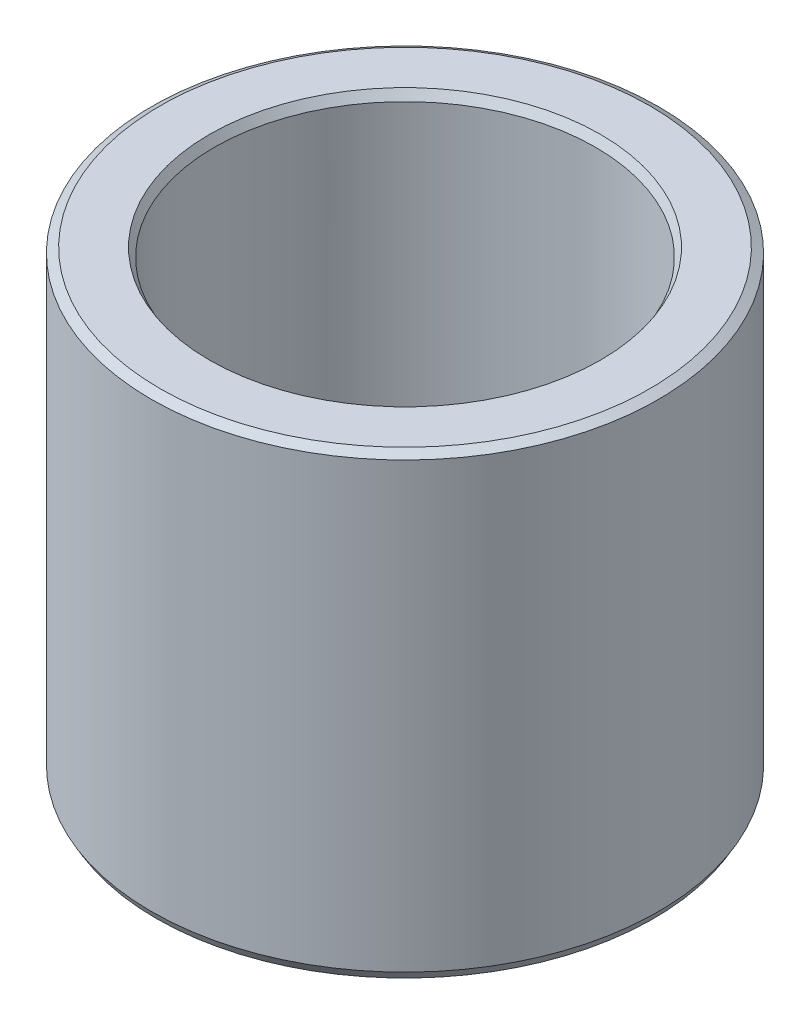
ISO-10303-21;
HEADER;
FILE_DESCRIPTION(('STEP AP214'),'2;1');
FILE_NAME('part.step','',(''),(''),'','','');
FILE_SCHEMA(('AUTOMOTIVE_DESIGN { 1 0 10303 214 1 1 1 1 }'));
ENDSEC;
DATA;
#1=APPLICATION_CONTEXT('core data for automotive mechanical design processes');
#2=APPLICATION_PROTOCOL_DEFINITION('international standard','automotive_design',2000,#1);
#3=PRODUCT_CONTEXT('',#1,'mechanical');
#4=PRODUCT('Part','Part','',(#3));
#5=PRODUCT_RELATED_PRODUCT_CATEGORY('part','',(#4));
#6=PRODUCT_DEFINITION_FORMATION('','',#4);
#7=PRODUCT_DEFINITION_CONTEXT('part definition',#1,'design');
#8=PRODUCT_DEFINITION('design','',#6,#7);
#9=PRODUCT_DEFINITION_SHAPE('','',#8);
#10=(LENGTH_UNIT() NAMED_UNIT(*) SI_UNIT(.MILLI.,.METRE.));
#11=(NAMED_UNIT(*) PLANE_ANGLE_UNIT() SI_UNIT($,.RADIAN.));
#12=(NAMED_UNIT(*) SI_UNIT($,.STERADIAN.) SOLID_ANGLE_UNIT());
#13=UNCERTAINTY_MEASURE_WITH_UNIT(LENGTH_MEASURE(1.E-05),#10,'distance_accuracy_value','');
#14=(GEOMETRIC_REPRESENTATION_CONTEXT(3) GLOBAL_UNCERTAINTY_ASSIGNED_CONTEXT((#13)) GLOBAL_UNIT_ASSIGNED_CONTEXT((#10,
#11,#12)) REPRESENTATION_CONTEXT('',''));
#15=CARTESIAN_POINT('',(0.,0.,0.));
#16=DIRECTION('',(0.,0.,1.));
#17=DIRECTION('',(1.,0.,0.));
#18=AXIS2_PLACEMENT_3D('',#15,#16,#17);
#19=CARTESIAN_POINT('',(0.,90.1398434243796,0.));
#20=DIRECTION('',(0.,-1.,0.));
#21=DIRECTION('',(0.,0.,-1.));
#22=AXIS2_PLACEMENT_3D('',#19,#20,#21);
#23=CYLINDRICAL_SURFACE('',#22,50.);
#24=CARTESIAN_POINT('',(0.,1.70152666208175,0.));
#25=DIRECTION('',(0.,1.,0.));
#26=DIRECTION('',(0.,0.,1.));
#27=AXIS2_PLACEMENT_3D('',#24,#25,#26);
#28=CIRCLE('',#27,50.);
#29=CARTESIAN_POINT('',(0.,1.70152666208173,-50.));
#30=VERTEX_POINT('',#29);
#31=EDGE_CURVE('E10',#30,#30,#28,.T.);
#32=CARTESIAN_POINT('',(0.,89.1574665479937,0.));
#33=DIRECTION('',(0.,1.,0.));
#34=DIRECTION('',(0.,0.,1.));
#35=AXIS2_PLACEMENT_3D('',#32,#33,#34);
#36=CIRCLE('',#35,50.);
#37=CARTESIAN_POINT('',(0.,89.1574665479936,-50.));
#38=VERTEX_POINT('',#37);
#39=EDGE_CURVE('E50',#38,#38,#36,.F.);
#40=CARTESIAN_POINT('',(0.,1.70152666208173,-50.));
#41=CARTESIAN_POINT('',(0.,2.61252603589331,-50.));
#42=CARTESIAN_POINT('',(0.,3.5235254097049,-50.));
#43=CARTESIAN_POINT('',(0.,5.34552415732807,-50.));
#44=CARTESIAN_POINT('',(0.,6.25652353113965,-50.));
#45=CARTESIAN_POINT('',(0.,8.07852227876282,-50.));
#46=CARTESIAN_POINT('',(0.,8.98952165257439,-50.));
#47=CARTESIAN_POINT('',(0.,10.8115204001976,-50.));
#48=CARTESIAN_POINT('',(0.,11.7225197740091,-50.));
#49=CARTESIAN_POINT('',(0.,13.5445185216323,-50.));
#50=CARTESIAN_POINT('',(0.,14.4555178954439,-50.));
#51=CARTESIAN_POINT('',(0.,16.2775166430671,-50.));
#52=CARTESIAN_POINT('',(0.,17.1885160168786,-50.));
#53=CARTESIAN_POINT('',(0.,19.0105147645018,-50.));
#54=CARTESIAN_POINT('',(0.,19.9215141383134,-50.));
#55=CARTESIAN_POINT('',(0.,21.7435128859365,-50.));
#56=CARTESIAN_POINT('',(0.,22.6545122597481,-50.));
#57=CARTESIAN_POINT('',(0.,24.4765110073713,-50.));
#58=CARTESIAN_POINT('',(0.,25.3875103811829,-50.));
#59=CARTESIAN_POINT('',(0.,27.209509128806,-50.));
#60=CARTESIAN_POINT('',(0.,28.1205085026176,-50.));
#61=CARTESIAN_POINT('',(0.,29.9425072502408,-50.));
#62=CARTESIAN_POINT('',(0.,30.8535066240524,-50.));
#63=CARTESIAN_POINT('',(0.,32.6755053716755,-50.));
#64=CARTESIAN_POINT('',(0.,33.5865047454871,-50.));
#65=CARTESIAN_POINT('',(0.,35.4085034931103,-50.));
#66=CARTESIAN_POINT('',(0.,36.3195028669219,-50.));
#67=CARTESIAN_POINT('',(0.,38.141501614545,-50.));
#68=CARTESIAN_POINT('',(0.,39.0525009883566,-50.));
#69=CARTESIAN_POINT('',(0.,40.8744997359798,-50.));
#70=CARTESIAN_POINT('',(0.,41.7854991097914,-50.));
#71=CARTESIAN_POINT('',(0.,43.6074978574145,-50.));
#72=CARTESIAN_POINT('',(0.,44.5184972312261,-50.));
#73=CARTESIAN_POINT('',(0.,46.3404959788493,-50.));
#74=CARTESIAN_POINT('',(0.,47.2514953526609,-50.));
#75=CARTESIAN_POINT('',(0.,49.073494100284,-50.));
#76=CARTESIAN_POINT('',(0.,49.9844934740956,-50.));
#77=CARTESIAN_POINT('',(0.,51.8064922217188,-50.));
#78=CARTESIAN_POINT('',(0.,52.7174915955304,-50.));
#79=CARTESIAN_POINT('',(0.,54.5394903431535,-50.));
#80=CARTESIAN_POINT('',(0.,55.4504897169651,-50.));
#81=CARTESIAN_POINT('',(0.,57.2724884645883,-50.));
#82=CARTESIAN_POINT('',(0.,58.1834878383998,-50.));
#83=CARTESIAN_POINT('',(0.,60.005486586023,-50.));
#84=CARTESIAN_POINT('',(0.,60.9164859598346,-50.));
#85=CARTESIAN_POINT('',(0.,62.7384847074578,-50.));
#86=CARTESIAN_POINT('',(0.,63.6494840812693,-50.));
#87=CARTESIAN_POINT('',(0.,65.4714828288925,-50.));
#88=CARTESIAN_POINT('',(0.,66.3824822027041,-50.));
#89=CARTESIAN_POINT('',(0.,68.2044809503273,-50.));
#90=CARTESIAN_POINT('',(0.,69.1154803241388,-50.));
#91=CARTESIAN_POINT('',(0.,70.937479071762,-50.));
#92=CARTESIAN_POINT('',(0.,71.8484784455736,-50.));
#93=CARTESIAN_POINT('',(0.,73.6704771931967,-50.));
#94=CARTESIAN_POINT('',(0.,74.5814765670083,-50.));
#95=CARTESIAN_POINT('',(0.,76.4034753146315,-50.));
#96=CARTESIAN_POINT('',(0.,77.3144746884431,-50.));
#97=CARTESIAN_POINT('',(0.,79.1364734360663,-50.));
#98=CARTESIAN_POINT('',(0.,80.0474728098778,-50.));
#99=CARTESIAN_POINT('',(0.,81.869471557501,-50.));
#100=CARTESIAN_POINT('',(0.,82.7804709313126,-50.));
#101=CARTESIAN_POINT('',(0.,84.6024696789357,-50.));
#102=CARTESIAN_POINT('',(0.,85.5134690527473,-50.));
#103=CARTESIAN_POINT('',(0.,87.3354678003705,-50.));
#104=CARTESIAN_POINT('',(0.,88.2464671741821,-50.));
#105=CARTESIAN_POINT('',(0.,89.1574665479936,-50.));
#106=B_SPLINE_CURVE_WITH_KNOTS('',3,(#40,#41,#42,#43,#44,#45,#46,#47,#48,#49,#50,#51,#52,#53,
#54,#55,#56,#57,#58,#59,#60,#61,#62,#63,#64,#65,#66,#67,#68,#69,#70,#71,#72,#73,#74,#75,#76,#77,
#78,#79,#80,#81,#82,#83,#84,#85,#86,#87,#88,#89,#90,#91,#92,#93,#94,#95,#96,#97,#98,#99,#100,
#101,#102,#103,#104,#105),.UNSPECIFIED.,.F.,.F.,(4,2,2,2,2,2,2,2,2,2,2,2,2,2,2,2,2,2,2,2,2,2,2,
2,2,2,2,2,2,2,2,2,4),(0.,2.73299812143475,5.4659962428695,8.19899436430424,10.931992485739,
13.6649906071737,16.3979887286085,19.1309868500432,21.863984971478,24.5969830929127,
27.3299812143475,30.0629793357822,32.795977457217,35.5289755786517,38.2619737000865,
40.9949718215212,43.727969942956,46.4609680643907,49.1939661858255,51.9269643072602,
54.659962428695,57.3929605501297,60.1259586715644,62.8589567929992,65.5919549144339,
68.3249530358687,71.0579511573034,73.7909492787382,76.5239474001729,79.2569455216077,
81.9899436430424,84.7229417644772,87.4559398859119),.UNSPECIFIED.);
#107=EDGE_CURVE('BSEAM39',#30,#38,#106,.T.);
#108=ORIENTED_EDGE('',*,*,#31,.T.);
#109=ORIENTED_EDGE('',*,*,#39,.T.);
#110=ORIENTED_EDGE('',*,*,#107,.T.);
#111=ORIENTED_EDGE('',*,*,#107,.F.);
#112=EDGE_LOOP('',(#108,#110,#109,#111));
#113=FACE_BOUND('',#112,.T.);
#114=ADVANCED_FACE('F39',(#113),#23,.T.);
#115=CARTESIAN_POINT('',(0.,90.1398434243796,0.));
#116=DIRECTION('',(0.,1.,0.));
#117=DIRECTION('',(0.,0.,1.));
#118=AXIS2_PLACEMENT_3D('',#115,#116,#117);
#119=PLANE('',#118);
#120=CARTESIAN_POINT('',(0.,90.1398434243796,0.));
#121=DIRECTION('',(0.,1.,0.));
#122=DIRECTION('',(0.,0.,1.));
#123=AXIS2_PLACEMENT_3D('',#120,#121,#122);
#124=CIRCLE('',#123,38.5553364159497);
#125=CARTESIAN_POINT('',(0.,90.1398434243796,38.5553364159497));
#126=VERTEX_POINT('',#125);
#127=EDGE_CURVE('E58',#126,#126,#124,.F.);
#128=ORIENTED_EDGE('',*,*,#127,.T.);
#129=EDGE_LOOP('',(#128));
#130=FACE_BOUND('',#129,.T.);
#131=CARTESIAN_POINT('',(0.,90.1398434243796,0.));
#132=DIRECTION('',(0.,1.,0.));
#133=DIRECTION('',(0.,0.,1.));
#134=AXIS2_PLACEMENT_3D('',#131,#132,#133);
#135=CIRCLE('',#134,48.2984733379187);
#136=CARTESIAN_POINT('',(0.,90.1398434243796,48.2984733379187));
#137=VERTEX_POINT('',#136);
#138=EDGE_CURVE('E61',#137,#137,#135,.T.);
#139=ORIENTED_EDGE('',*,*,#138,.T.);
#140=EDGE_LOOP('',(#139));
#141=FACE_BOUND('',#140,.T.);
#142=ADVANCED_FACE('F88',(#130,#141),#119,.T.);
#143=CARTESIAN_POINT('',(0.,0.,0.));
#144=DIRECTION('',(0.,1.,0.));
#145=DIRECTION('',(0.,0.,1.));
#146=AXIS2_PLACEMENT_3D('',#143,#144,#145);
#147=PLANE('',#146);
#148=CARTESIAN_POINT('',(0.,0.,0.));
#149=DIRECTION('',(0.,1.,0.));
#150=DIRECTION('',(0.,0.,1.));
#151=AXIS2_PLACEMENT_3D('',#148,#149,#150);
#152=CIRCLE('',#151,39.2744862016449);
#153=CARTESIAN_POINT('',(0.,0.,39.2744862016449));
#154=VERTEX_POINT('',#153);
#155=EDGE_CURVE('E51',#154,#154,#152,.T.);
#156=ORIENTED_EDGE('',*,*,#155,.T.);
#157=EDGE_LOOP('',(#156));
#158=FACE_BOUND('',#157,.T.);
#159=CARTESIAN_POINT('',(0.,0.,0.));
#160=DIRECTION('',(0.,1.,0.));
#161=DIRECTION('',(0.,0.,1.));
#162=AXIS2_PLACEMENT_3D('',#159,#160,#161);
#163=CIRCLE('',#162,49.0176231236138);
#164=CARTESIAN_POINT('',(0.,0.,49.0176231236138));
#165=VERTEX_POINT('',#164);
#166=EDGE_CURVE('E54',#165,#165,#163,.F.);
#167=ORIENTED_EDGE('',*,*,#166,.T.);
#168=EDGE_LOOP('',(#167));
#169=FACE_BOUND('',#168,.T.);
#170=ADVANCED_FACE('F83',(#158,#169),#147,.F.);
#171=CARTESIAN_POINT('',(0.,90.1398434243796,0.));
#172=DIRECTION('',(0.,-1.,0.));
#173=DIRECTION('',(0.,0.,-1.));
#174=AXIS2_PLACEMENT_3D('',#171,#172,#173);
#175=CYLINDRICAL_SURFACE('',#174,37.5729595395635);
#176=CARTESIAN_POINT('',(0.,88.4383167622981,0.));
#177=DIRECTION('',(0.,1.,0.));
#178=DIRECTION('',(0.,0.,1.));
#179=AXIS2_PLACEMENT_3D('',#176,#177,#178);
#180=CIRCLE('',#179,37.5729595395635);
#181=CARTESIAN_POINT('',(0.,88.4383167622981,-37.5729595395635));
#182=VERTEX_POINT('',#181);
#183=EDGE_CURVE('E67',#182,#182,#180,.T.);
#184=CARTESIAN_POINT('',(0.,0.982376876386026,0.));
#185=DIRECTION('',(0.,1.,0.));
#186=DIRECTION('',(0.,0.,1.));
#187=AXIS2_PLACEMENT_3D('',#184,#185,#186);
#188=CIRCLE('',#187,37.5729595395635);
#189=CARTESIAN_POINT('',(0.,0.982376876386026,-37.5729595395635));
#190=VERTEX_POINT('',#189);
#191=EDGE_CURVE('E69',#190,#190,#188,.F.);
#192=CARTESIAN_POINT('',(0.,88.4383167622981,-37.5729595395635));
#193=CARTESIAN_POINT('',(0.,87.5273173884865,-37.5729595395635));
#194=CARTESIAN_POINT('',(0.,86.6163180146749,-37.5729595395635));
#195=CARTESIAN_POINT('',(0.,84.7943192670517,-37.5729595395635));
#196=CARTESIAN_POINT('',(0.,83.8833198932402,-37.5729595395635));
#197=CARTESIAN_POINT('',(0.,82.061321145617,-37.5729595395635));
#198=CARTESIAN_POINT('',(0.,81.1503217718054,-37.5729595395635));
#199=CARTESIAN_POINT('',(0.,79.3283230241822,-37.5729595395635));
#200=CARTESIAN_POINT('',(0.,78.4173236503707,-37.5729595395635));
#201=CARTESIAN_POINT('',(0.,76.5953249027475,-37.5729595395635));
#202=CARTESIAN_POINT('',(0.,75.6843255289359,-37.5729595395635));
#203=CARTESIAN_POINT('',(0.,73.8623267813127,-37.5729595395635));
#204=CARTESIAN_POINT('',(0.,72.9513274075012,-37.5729595395635));
#205=CARTESIAN_POINT('',(0.,71.129328659878,-37.5729595395635));
#206=CARTESIAN_POINT('',(0.,70.2183292860664,-37.5729595395635));
#207=CARTESIAN_POINT('',(0.,68.3963305384432,-37.5729595395635));
#208=CARTESIAN_POINT('',(0.,67.4853311646316,-37.5729595395635));
#209=CARTESIAN_POINT('',(0.,65.6633324170085,-37.5729595395635));
#210=CARTESIAN_POINT('',(0.,64.7523330431969,-37.5729595395635));
#211=CARTESIAN_POINT('',(0.,62.9303342955737,-37.5729595395635));
#212=CARTESIAN_POINT('',(0.,62.0193349217621,-37.5729595395635));
#213=CARTESIAN_POINT('',(0.,60.197336174139,-37.5729595395635));
#214=CARTESIAN_POINT('',(0.,59.2863368003274,-37.5729595395635));
#215=CARTESIAN_POINT('',(0.,57.4643380527042,-37.5729595395635));
#216=CARTESIAN_POINT('',(0.,56.5533386788926,-37.5729595395635));
#217=CARTESIAN_POINT('',(0.,54.7313399312695,-37.5729595395635));
#218=CARTESIAN_POINT('',(0.,53.8203405574579,-37.5729595395635));
#219=CARTESIAN_POINT('',(0.,51.9983418098347,-37.5729595395635));
#220=CARTESIAN_POINT('',(0.,51.0873424360231,-37.5729595395635));
#221=CARTESIAN_POINT('',(0.,49.2653436884,-37.5729595395635));
#222=CARTESIAN_POINT('',(0.,48.3543443145884,-37.5729595395635));
#223=CARTESIAN_POINT('',(0.,46.5323455669652,-37.5729595395635));
#224=CARTESIAN_POINT('',(0.,45.6213461931536,-37.5729595395635));
#225=CARTESIAN_POINT('',(0.,43.7993474455305,-37.5729595395635));
#226=CARTESIAN_POINT('',(0.,42.8883480717189,-37.5729595395635));
#227=CARTESIAN_POINT('',(0.,41.0663493240957,-37.5729595395635));
#228=CARTESIAN_POINT('',(0.,40.1553499502841,-37.5729595395635));
#229=CARTESIAN_POINT('',(0.,38.333351202661,-37.5729595395635));
#230=CARTESIAN_POINT('',(0.,37.4223518288494,-37.5729595395635));
#231=CARTESIAN_POINT('',(0.,35.6003530812262,-37.5729595395635));
#232=CARTESIAN_POINT('',(0.,34.6893537074146,-37.5729595395635));
#233=CARTESIAN_POINT('',(0.,32.8673549597915,-37.5729595395635));
#234=CARTESIAN_POINT('',(0.,31.9563555859799,-37.5729595395635));
#235=CARTESIAN_POINT('',(0.,30.1343568383567,-37.5729595395635));
#236=CARTESIAN_POINT('',(0.,29.2233574645451,-37.5729595395635));
#237=CARTESIAN_POINT('',(0.,27.401358716922,-37.5729595395635));
#238=CARTESIAN_POINT('',(0.,26.4903593431104,-37.5729595395635));
#239=CARTESIAN_POINT('',(0.,24.6683605954872,-37.5729595395635));
#240=CARTESIAN_POINT('',(0.,23.7573612216756,-37.5729595395635));
#241=CARTESIAN_POINT('',(0.,21.9353624740525,-37.5729595395635));
#242=CARTESIAN_POINT('',(0.,21.0243631002409,-37.5729595395635));
#243=CARTESIAN_POINT('',(0.,19.2023643526177,-37.5729595395635));
#244=CARTESIAN_POINT('',(0.,18.2913649788061,-37.5729595395635));
#245=CARTESIAN_POINT('',(0.,16.4693662311829,-37.5729595395635));
#246=CARTESIAN_POINT('',(0.,15.5583668573714,-37.5729595395635));
#247=CARTESIAN_POINT('',(0.,13.7363681097482,-37.5729595395635));
#248=CARTESIAN_POINT('',(0.,12.8253687359366,-37.5729595395635));
#249=CARTESIAN_POINT('',(0.,11.0033699883134,-37.5729595395635));
#250=CARTESIAN_POINT('',(0.,10.0923706145019,-37.5729595395635));
#251=CARTESIAN_POINT('',(0.,8.2703718668787,-37.5729595395635));
#252=CARTESIAN_POINT('',(0.,7.35937249306711,-37.5729595395635));
#253=CARTESIAN_POINT('',(0.,5.53737374544395,-37.5729595395635));
#254=CARTESIAN_POINT('',(0.,4.62637437163236,-37.5729595395635));
#255=CARTESIAN_POINT('',(0.,2.80437562400919,-37.5729595395635));
#256=CARTESIAN_POINT('',(0.,1.89337625019761,-37.5729595395635));
#257=CARTESIAN_POINT('',(0.,0.982376876386026,-37.5729595395635));
#258=B_SPLINE_CURVE_WITH_KNOTS('',3,(#192,#193,#194,#195,#196,#197,#198,#199,#200,#201,#202,
#203,#204,#205,#206,#207,#208,#209,#210,#211,#212,#213,#214,#215,#216,#217,#218,#219,#220,#221,
#222,#223,#224,#225,#226,#227,#228,#229,#230,#231,#232,#233,#234,#235,#236,#237,#238,#239,#240,
#241,#242,#243,#244,#245,#246,#247,#248,#249,#250,#251,#252,#253,#254,#255,#256,#257),
.UNSPECIFIED.,.F.,.F.,(4,2,2,2,2,2,2,2,2,2,2,2,2,2,2,2,2,2,2,2,2,2,2,2,2,2,2,2,2,2,2,2,4),(0.,
2.73299812143474,5.46599624286949,8.19899436430424,10.931992485739,13.6649906071737,
16.3979887286085,19.1309868500432,21.863984971478,24.5969830929128,27.3299812143475,
30.0629793357823,32.795977457217,35.5289755786518,38.2619737000865,40.9949718215213,
43.727969942956,46.4609680643908,49.1939661858255,51.9269643072603,54.659962428695,
57.3929605501298,60.1259586715645,62.8589567929993,65.591954914434,68.3249530358688,
71.0579511573035,73.7909492787383,76.523947400173,79.2569455216078,81.9899436430425,
84.7229417644773,87.455939885912),.UNSPECIFIED.);
#259=EDGE_CURVE('BSEAM71',#182,#190,#258,.T.);
#260=ORIENTED_EDGE('',*,*,#183,.T.);
#261=ORIENTED_EDGE('',*,*,#191,.T.);
#262=ORIENTED_EDGE('',*,*,#259,.T.);
#263=ORIENTED_EDGE('',*,*,#259,.F.);
#264=EDGE_LOOP('',(#260,#262,#261,#263));
#265=FACE_BOUND('',#264,.T.);
#266=ADVANCED_FACE('F71',(#265),#175,.F.);
#267=CARTESIAN_POINT('',(0.,88.4383167622981,0.));
#268=DIRECTION('',(0.,1.,0.));
#269=DIRECTION('',(0.,0.,1.));
#270=AXIS2_PLACEMENT_3D('',#267,#268,#269);
#271=CONICAL_SURFACE('',#270,37.5729595395635,0.523598775598298);
#272=ORIENTED_EDGE('',*,*,#127,.F.);
#273=EDGE_LOOP('',(#272));
#274=FACE_BOUND('',#273,.T.);
#275=ORIENTED_EDGE('',*,*,#183,.F.);
#276=EDGE_LOOP('',(#275));
#277=FACE_BOUND('',#276,.T.);
#278=ADVANCED_FACE('F77',(#274,#277),#271,.F.);
#279=CARTESIAN_POINT('',(0.,0.,0.));
#280=DIRECTION('',(0.,-1.,0.));
#281=DIRECTION('',(0.,0.,-1.));
#282=AXIS2_PLACEMENT_3D('',#279,#280,#281);
#283=CONICAL_SURFACE('',#282,39.2744862016449,1.04719755119659);
#284=ORIENTED_EDGE('',*,*,#191,.F.);
#285=EDGE_LOOP('',(#284));
#286=FACE_BOUND('',#285,.T.);
#287=ORIENTED_EDGE('',*,*,#155,.F.);
#288=EDGE_LOOP('',(#287));
#289=FACE_BOUND('',#288,.T.);
#290=ADVANCED_FACE('F73',(#286,#289),#283,.F.);
#291=CARTESIAN_POINT('',(0.,1.70152666208175,0.));
#292=DIRECTION('',(0.,1.,0.));
#293=DIRECTION('',(0.,0.,1.));
#294=AXIS2_PLACEMENT_3D('',#291,#292,#293);
#295=CONICAL_SURFACE('',#294,50.,0.523598775598302);
#296=ORIENTED_EDGE('',*,*,#166,.F.);
#297=EDGE_LOOP('',(#296));
#298=FACE_BOUND('',#297,.T.);
#299=ORIENTED_EDGE('',*,*,#31,.F.);
#300=EDGE_LOOP('',(#299));
#301=FACE_BOUND('',#300,.T.);
#302=ADVANCED_FACE('F76',(#298,#301),#295,.T.);
#303=CARTESIAN_POINT('',(0.,90.1398434243796,0.));
#304=DIRECTION('',(0.,-1.,0.));
#305=DIRECTION('',(0.,0.,-1.));
#306=AXIS2_PLACEMENT_3D('',#303,#304,#305);
#307=CONICAL_SURFACE('',#306,48.2984733379187,1.0471975511966);
#308=ORIENTED_EDGE('',*,*,#39,.F.);
#309=EDGE_LOOP('',(#308));
#310=FACE_BOUND('',#309,.T.);
#311=ORIENTED_EDGE('',*,*,#138,.F.);
#312=EDGE_LOOP('',(#311));
#313=FACE_BOUND('',#312,.T.);
#314=ADVANCED_FACE('F45',(#310,#313),#307,.T.);
#315=CLOSED_SHELL('',(#114,#142,#170,#266,#278,#290,#302,#314));
#316=MANIFOLD_SOLID_BREP('B2',#315);
#317=ADVANCED_BREP_SHAPE_REPRESENTATION('',(#18,#316),#14);
#318=SHAPE_DEFINITION_REPRESENTATION(#9,#317);
ENDSEC;
END-ISO-10303-21;
